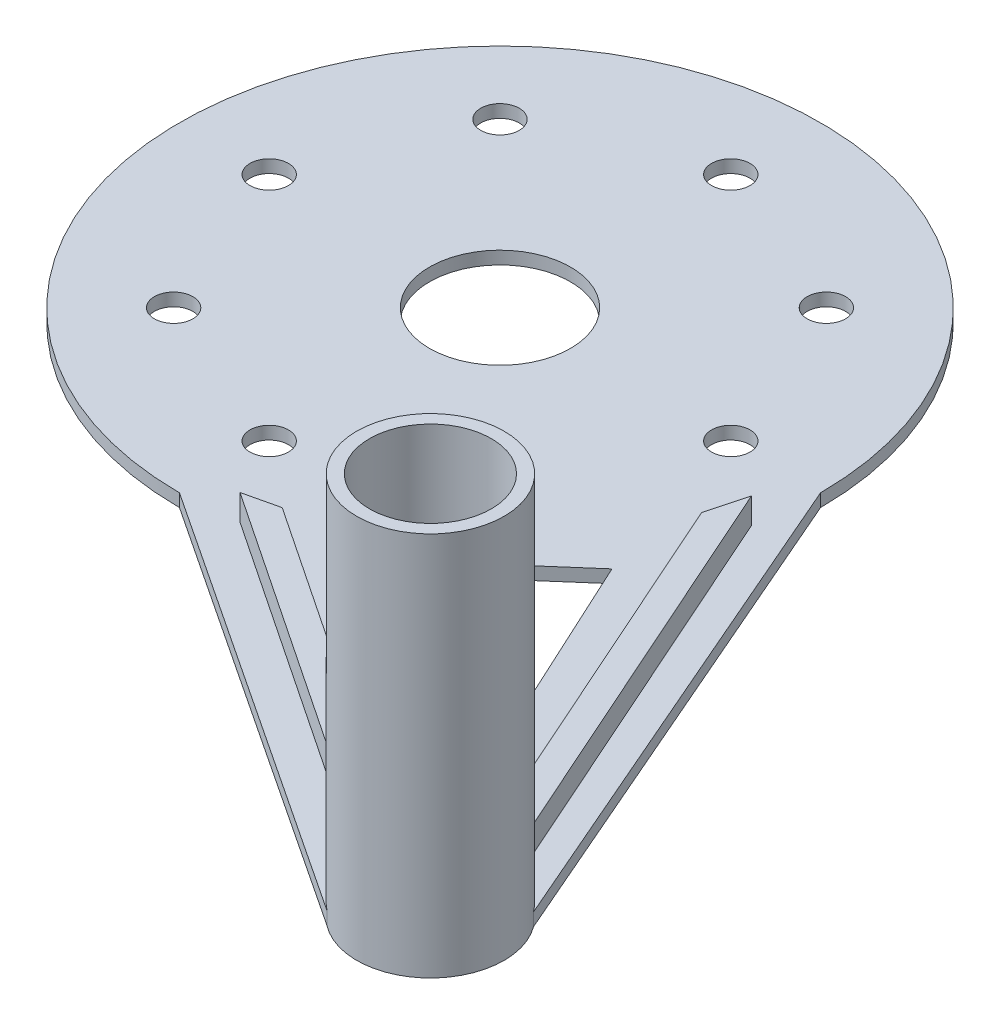
ISO-10303-21;
HEADER;
FILE_DESCRIPTION(('STEP AP214'),'2;1');
FILE_NAME('part.step','',(''),(''),'','','');
FILE_SCHEMA(('AUTOMOTIVE_DESIGN { 1 0 10303 214 1 1 1 1 }'));
ENDSEC;
DATA;
#1=APPLICATION_CONTEXT('core data for automotive mechanical design processes');
#2=APPLICATION_PROTOCOL_DEFINITION('international standard','automotive_design',2000,#1);
#3=PRODUCT_CONTEXT('',#1,'mechanical');
#4=PRODUCT('Part','Part','',(#3));
#5=PRODUCT_RELATED_PRODUCT_CATEGORY('part','',(#4));
#6=PRODUCT_DEFINITION_FORMATION('','',#4);
#7=PRODUCT_DEFINITION_CONTEXT('part definition',#1,'design');
#8=PRODUCT_DEFINITION('design','',#6,#7);
#9=PRODUCT_DEFINITION_SHAPE('','',#8);
#10=(LENGTH_UNIT() NAMED_UNIT(*) SI_UNIT(.MILLI.,.METRE.));
#11=(NAMED_UNIT(*) PLANE_ANGLE_UNIT() SI_UNIT($,.RADIAN.));
#12=(NAMED_UNIT(*) SI_UNIT($,.STERADIAN.) SOLID_ANGLE_UNIT());
#13=UNCERTAINTY_MEASURE_WITH_UNIT(LENGTH_MEASURE(1.E-05),#10,'distance_accuracy_value','');
#14=(GEOMETRIC_REPRESENTATION_CONTEXT(3) GLOBAL_UNCERTAINTY_ASSIGNED_CONTEXT((#13)) GLOBAL_UNIT_ASSIGNED_CONTEXT((#10,
#11,#12)) REPRESENTATION_CONTEXT('',''));
#15=CARTESIAN_POINT('',(0.,0.,0.));
#16=DIRECTION('',(0.,0.,1.));
#17=DIRECTION('',(1.,0.,0.));
#18=AXIS2_PLACEMENT_3D('',#15,#16,#17);
#19=CARTESIAN_POINT('',(37.5,1.,42.9272640637625));
#20=DIRECTION('',(0.,1.,0.));
#21=DIRECTION('',(0.,0.,1.));
#22=AXIS2_PLACEMENT_3D('',#19,#20,#21);
#23=PLANE('',#22);
#24=CARTESIAN_POINT('',(18.,1.,1.89805075011018E-13));
#25=DIRECTION('',(0.,1.,0.));
#26=DIRECTION('',(0.,0.,1.));
#27=AXIS2_PLACEMENT_3D('',#24,#25,#26);
#28=CIRCLE('',#27,1.5);
#29=CARTESIAN_POINT('',(18.,1.,1.50000000000019));
#30=VERTEX_POINT('',#29);
#31=EDGE_CURVE('E236',#30,#30,#28,.T.);
#32=ORIENTED_EDGE('',*,*,#31,.F.);
#33=EDGE_LOOP('',(#32));
#34=FACE_BOUND('',#33,.T.);
#35=CARTESIAN_POINT('',(1.23488963959888E-13,1.,-18.));
#36=DIRECTION('',(0.,1.,0.));
#37=DIRECTION('',(0.,0.,1.));
#38=AXIS2_PLACEMENT_3D('',#35,#36,#37);
#39=CIRCLE('',#38,1.5);
#40=CARTESIAN_POINT('',(1.23488963959888E-13,1.,-16.5));
#41=VERTEX_POINT('',#40);
#42=EDGE_CURVE('E248',#41,#41,#39,.T.);
#43=ORIENTED_EDGE('',*,*,#42,.F.);
#44=EDGE_LOOP('',(#43));
#45=FACE_BOUND('',#44,.T.);
#46=CARTESIAN_POINT('',(-18.,1.,0.));
#47=DIRECTION('',(0.,1.,0.));
#48=DIRECTION('',(0.,0.,1.));
#49=AXIS2_PLACEMENT_3D('',#46,#47,#48);
#50=CIRCLE('',#49,1.5);
#51=CARTESIAN_POINT('',(-18.,1.,1.49999999999994));
#52=VERTEX_POINT('',#51);
#53=EDGE_CURVE('E260',#52,#52,#50,.T.);
#54=ORIENTED_EDGE('',*,*,#53,.F.);
#55=EDGE_LOOP('',(#54));
#56=FACE_BOUND('',#55,.T.);
#57=CARTESIAN_POINT('',(0.,1.,18.));
#58=DIRECTION('',(0.,1.,0.));
#59=DIRECTION('',(0.,0.,1.));
#60=AXIS2_PLACEMENT_3D('',#57,#58,#59);
#61=CIRCLE('',#60,1.5);
#62=CARTESIAN_POINT('',(0.,1.,19.5));
#63=VERTEX_POINT('',#62);
#64=EDGE_CURVE('E272',#63,#63,#61,.T.);
#65=ORIENTED_EDGE('',*,*,#64,.F.);
#66=EDGE_LOOP('',(#65));
#67=FACE_BOUND('',#66,.T.);
#68=CARTESIAN_POINT('',(0.,1.,0.));
#69=DIRECTION('',(0.,1.,0.));
#70=DIRECTION('',(0.,0.,1.));
#71=AXIS2_PLACEMENT_3D('',#68,#69,#70);
#72=CIRCLE('',#71,5.5);
#73=CARTESIAN_POINT('',(0.,1.,5.5));
#74=VERTEX_POINT('',#73);
#75=EDGE_CURVE('E278',#74,#74,#72,.T.);
#76=ORIENTED_EDGE('',*,*,#75,.F.);
#77=EDGE_LOOP('',(#76));
#78=FACE_BOUND('',#77,.T.);
#79=CARTESIAN_POINT('',(-12.7279220613579,1.,12.7279220613578));
#80=DIRECTION('',(0.,1.,0.));
#81=DIRECTION('',(0.,0.,1.));
#82=AXIS2_PLACEMENT_3D('',#79,#80,#81);
#83=CIRCLE('',#82,1.5);
#84=CARTESIAN_POINT('',(-12.7279220613579,1.,14.2279220613578));
#85=VERTEX_POINT('',#84);
#86=EDGE_CURVE('E266',#85,#85,#83,.T.);
#87=ORIENTED_EDGE('',*,*,#86,.F.);
#88=EDGE_LOOP('',(#87));
#89=FACE_BOUND('',#88,.T.);
#90=CARTESIAN_POINT('',(-12.7279220613578,1.,-12.7279220613579));
#91=DIRECTION('',(0.,1.,0.));
#92=DIRECTION('',(0.,0.,1.));
#93=AXIS2_PLACEMENT_3D('',#90,#91,#92);
#94=CIRCLE('',#93,1.5);
#95=CARTESIAN_POINT('',(-12.7279220613578,1.,-11.2279220613579));
#96=VERTEX_POINT('',#95);
#97=EDGE_CURVE('E254',#96,#96,#94,.T.);
#98=ORIENTED_EDGE('',*,*,#97,.F.);
#99=EDGE_LOOP('',(#98));
#100=FACE_BOUND('',#99,.T.);
#101=CARTESIAN_POINT('',(12.727922061358,1.,-12.7279220613577));
#102=DIRECTION('',(0.,1.,0.));
#103=DIRECTION('',(0.,0.,1.));
#104=AXIS2_PLACEMENT_3D('',#101,#102,#103);
#105=CIRCLE('',#104,1.5);
#106=CARTESIAN_POINT('',(12.727922061358,1.,-11.2279220613577));
#107=VERTEX_POINT('',#106);
#108=EDGE_CURVE('E242',#107,#107,#105,.T.);
#109=ORIENTED_EDGE('',*,*,#108,.F.);
#110=EDGE_LOOP('',(#109));
#111=FACE_BOUND('',#110,.T.);
#112=CARTESIAN_POINT('',(12.7279220613577,1.,12.727922061358));
#113=DIRECTION('',(0.,1.,0.));
#114=DIRECTION('',(0.,0.,1.));
#115=AXIS2_PLACEMENT_3D('',#112,#113,#114);
#116=CIRCLE('',#115,1.5);
#117=CARTESIAN_POINT('',(12.7279220613577,1.,14.227922061358));
#118=VERTEX_POINT('',#117);
#119=EDGE_CURVE('E230',#118,#118,#116,.T.);
#120=ORIENTED_EDGE('',*,*,#119,.F.);
#121=EDGE_LOOP('',(#120));
#122=FACE_BOUND('',#121,.T.);
#123=DIRECTION('',(-0.257967944638198,0.,0.966153476182301));
#124=VECTOR('',#123,1.);
#125=CARTESIAN_POINT('',(24.5152514726974,1.,4.89922904449338));
#126=LINE('',#125,#124);
#127=CARTESIAN_POINT('',(24.5152514726974,1.,4.89922904449338));
#128=VERTEX_POINT('',#127);
#129=CARTESIAN_POINT('',(23.6945306551304,1.,7.97303060530217));
#130=VERTEX_POINT('',#129);
#131=EDGE_CURVE('E50',#128,#130,#126,.T.);
#132=ORIENTED_EDGE('',*,*,#131,.F.);
#133=DIRECTION('',(-0.406739041840406,0.,-0.913544389640015));
#134=VECTOR('',#133,1.);
#135=CARTESIAN_POINT('',(38.971739634211,1.,37.3688036250176));
#136=LINE('',#135,#134);
#137=CARTESIAN_POINT('',(38.971739634211,1.,37.3688036250176));
#138=VERTEX_POINT('',#137);
#139=EDGE_CURVE('E170',#138,#128,#136,.T.);
#140=ORIENTED_EDGE('',*,*,#139,.F.);
#141=CARTESIAN_POINT('',(37.5,1.,42.9272640637625));
#142=DIRECTION('',(0.,1.,0.));
#143=DIRECTION('',(0.,0.,1.));
#144=AXIS2_PLACEMENT_3D('',#141,#142,#143);
#145=CIRCLE('',#144,5.75);
#146=CARTESIAN_POINT('',(42.1161587762646,0.999999999999997,39.4989148761337));
#147=VERTEX_POINT('',#146);
#148=EDGE_CURVE('E144',#138,#147,#145,.F.);
#149=ORIENTED_EDGE('',*,*,#148,.T.);
#150=DIRECTION('',(-0.397606700903918,0.,-0.917555944559405));
#151=VECTOR('',#150,1.);
#152=CARTESIAN_POINT('',(25.,1.,0.));
#153=LINE('',#152,#151);
#154=CARTESIAN_POINT('',(25.,1.,0.));
#155=VERTEX_POINT('',#154);
#156=EDGE_CURVE('E292',#147,#155,#153,.T.);
#157=ORIENTED_EDGE('',*,*,#156,.T.);
#158=CARTESIAN_POINT('',(0.,1.,0.));
#159=DIRECTION('',(0.,1.,0.));
#160=DIRECTION('',(0.,0.,1.));
#161=AXIS2_PLACEMENT_3D('',#158,#159,#160);
#162=CIRCLE('',#161,25.);
#163=CARTESIAN_POINT('',(0.,1.,25.));
#164=VERTEX_POINT('',#163);
#165=EDGE_CURVE('E284',#155,#164,#162,.T.);
#166=ORIENTED_EDGE('',*,*,#165,.T.);
#167=DIRECTION('',(0.834082354115995,0.,0.551639942854322));
#168=VECTOR('',#167,1.);
#169=CARTESIAN_POINT('',(0.,1.,25.));
#170=LINE('',#169,#168);
#171=CARTESIAN_POINT('',(33.9760220531749,1.,47.4708396854828));
#172=VERTEX_POINT('',#171);
#173=EDGE_CURVE('E290',#164,#172,#170,.T.);
#174=ORIENTED_EDGE('',*,*,#173,.T.);
#175=CARTESIAN_POINT('',(31.75,1.,42.9272640637625));
#176=VERTEX_POINT('',#175);
#177=EDGE_CURVE('E224',#172,#176,#145,.F.);
#178=ORIENTED_EDGE('',*,*,#177,.T.);
#179=DIRECTION('',(0.831556901500634,0.,0.555439573281077));
#180=VECTOR('',#179,1.);
#181=CARTESIAN_POINT('',(31.75,1.,42.9272640637625));
#182=LINE('',#181,#180);
#183=CARTESIAN_POINT('',(4.34200079896958,1.,24.6200533927477));
#184=VERTEX_POINT('',#183);
#185=EDGE_CURVE('E182',#184,#176,#182,.T.);
#186=ORIENTED_EDGE('',*,*,#185,.F.);
#187=DIRECTION('',(-0.973805425643835,0.,0.227382921492862));
#188=VECTOR('',#187,1.);
#189=CARTESIAN_POINT('',(4.34200079896958,1.,24.6200533927477));
#190=LINE('',#189,#188);
#191=CARTESIAN_POINT('',(7.0100635431187,1.,23.9970625102623));
#192=VERTEX_POINT('',#191);
#193=EDGE_CURVE('E190',#192,#184,#190,.T.);
#194=ORIENTED_EDGE('',*,*,#193,.F.);
#195=DIRECTION('',(-0.831556901500634,0.,-0.555439573281077));
#196=VECTOR('',#195,1.);
#197=CARTESIAN_POINT('',(7.0100635431187,1.,23.9970625102623));
#198=LINE('',#197,#196);
#199=CARTESIAN_POINT('',(32.1596598808811,1.,40.7957698901535));
#200=VERTEX_POINT('',#199);
#201=EDGE_CURVE('E147',#200,#192,#198,.T.);
#202=ORIENTED_EDGE('',*,*,#201,.F.);
#203=CARTESIAN_POINT('',(33.7171052631579,1.,38.5968821625935));
#204=VERTEX_POINT('',#203);
#205=EDGE_CURVE('E228',#200,#204,#145,.F.);
#206=ORIENTED_EDGE('',*,*,#205,.T.);
#207=DIRECTION('',(0.844276420330165,0.,0.535907945522813));
#208=VECTOR('',#207,1.);
#209=CARTESIAN_POINT('',(10.1451785504698,1.,23.6345043057407));
#210=LINE('',#209,#208);
#211=CARTESIAN_POINT('',(10.1451785504698,1.,23.6345043057407));
#212=VERTEX_POINT('',#211);
#213=EDGE_CURVE('E205',#212,#204,#210,.T.);
#214=ORIENTED_EDGE('',*,*,#213,.F.);
#215=DIRECTION('',(-0.753109895855483,0.,0.657894736842105));
#216=VECTOR('',#215,1.);
#217=CARTESIAN_POINT('',(16.1012096374802,1.,18.4314900761096));
#218=LINE('',#217,#216);
#219=CARTESIAN_POINT('',(22.0068158234685,1.,13.272525562424));
#220=VERTEX_POINT('',#219);
#221=EDGE_CURVE('E211',#220,#212,#218,.T.);
#222=ORIENTED_EDGE('',*,*,#221,.F.);
#223=DIRECTION('',(-0.419711796445546,0.,-0.90765742872763));
#224=VECTOR('',#223,1.);
#225=CARTESIAN_POINT('',(22.0068158234685,1.,13.272525562424));
#226=LINE('',#225,#224);
#227=EDGE_CURVE('E208',#204,#220,#226,.T.);
#228=ORIENTED_EDGE('',*,*,#227,.F.);
#229=CARTESIAN_POINT('',(36.7208003150846,1.,37.2303045368721));
#230=VERTEX_POINT('',#229);
#231=EDGE_CURVE('E229',#204,#230,#145,.F.);
#232=ORIENTED_EDGE('',*,*,#231,.T.);
#233=DIRECTION('',(0.406739041840406,0.,0.913544389640015));
#234=VECTOR('',#233,1.);
#235=CARTESIAN_POINT('',(23.6945306551304,1.,7.97303060530216));
#236=LINE('',#235,#234);
#237=EDGE_CURVE('E55',#130,#230,#236,.T.);
#238=ORIENTED_EDGE('',*,*,#237,.F.);
#239=EDGE_LOOP('',(#132,#140,#149,#157,#166,#174,#178,#186,#194,#202,#206,#214,#222,#228,#232,#238));
#240=FACE_BOUND('',#239,.T.);
#241=ADVANCED_FACE('F35',(#34,#45,#56,#67,#78,#89,#100,#111,#122,#240),#23,.T.);
#242=CARTESIAN_POINT('',(37.5,1.,42.9272640637625));
#243=DIRECTION('',(0.,-1.,0.));
#244=DIRECTION('',(0.,0.,-1.));
#245=AXIS2_PLACEMENT_3D('',#242,#243,#244);
#246=CYLINDRICAL_SURFACE('',#245,5.74999999999999);
#247=CARTESIAN_POINT('',(37.5,30.,42.9272640637625));
#248=DIRECTION('',(0.,1.,0.));
#249=DIRECTION('',(0.,0.,1.));
#250=AXIS2_PLACEMENT_3D('',#247,#248,#249);
#251=CIRCLE('',#250,5.75);
#252=CARTESIAN_POINT('',(37.5,30.,48.6772640637625));
#253=VERTEX_POINT('',#252);
#254=EDGE_CURVE('E216',#253,#253,#251,.T.);
#255=ORIENTED_EDGE('',*,*,#254,.F.);
#256=EDGE_LOOP('',(#255));
#257=FACE_BOUND('',#256,.T.);
#258=DIRECTION('',(0.,-1.,0.));
#259=VECTOR('',#258,1.);
#260=CARTESIAN_POINT('',(38.971739634211,3.,37.3688036250176));
#261=LINE('',#260,#259);
#262=CARTESIAN_POINT('',(38.971739634211,3.,37.3688036250176));
#263=VERTEX_POINT('',#262);
#264=EDGE_CURVE('E141',#263,#138,#261,.T.);
#265=ORIENTED_EDGE('',*,*,#264,.F.);
#266=CARTESIAN_POINT('',(37.5,3.,42.9272640637625));
#267=DIRECTION('',(0.,-1.,0.));
#268=DIRECTION('',(0.,0.,-1.));
#269=AXIS2_PLACEMENT_3D('',#266,#267,#268);
#270=CIRCLE('',#269,5.74999999999999);
#271=CARTESIAN_POINT('',(36.7208003150846,3.,37.2303045368721));
#272=VERTEX_POINT('',#271);
#273=EDGE_CURVE('E11',#272,#263,#270,.T.);
#274=ORIENTED_EDGE('',*,*,#273,.F.);
#275=DIRECTION('',(0.,-1.,0.));
#276=VECTOR('',#275,1.);
#277=CARTESIAN_POINT('',(36.7208003150846,3.,37.2303045368721));
#278=LINE('',#277,#276);
#279=EDGE_CURVE('E169',#272,#230,#278,.T.);
#280=ORIENTED_EDGE('',*,*,#279,.T.);
#281=ORIENTED_EDGE('',*,*,#231,.F.);
#282=ORIENTED_EDGE('',*,*,#205,.F.);
#283=DIRECTION('',(0.,-1.,0.));
#284=VECTOR('',#283,1.);
#285=CARTESIAN_POINT('',(32.1596598808811,3.,40.7957698901535));
#286=LINE('',#285,#284);
#287=CARTESIAN_POINT('',(32.1596598808811,3.,40.7957698901535));
#288=VERTEX_POINT('',#287);
#289=EDGE_CURVE('E202',#288,#200,#286,.T.);
#290=ORIENTED_EDGE('',*,*,#289,.F.);
#291=CARTESIAN_POINT('',(37.5,3.,42.9272640637625));
#292=DIRECTION('',(0.,-1.,0.));
#293=DIRECTION('',(0.,0.,-1.));
#294=AXIS2_PLACEMENT_3D('',#291,#292,#293);
#295=CIRCLE('',#294,5.74999999999999);
#296=CARTESIAN_POINT('',(31.75,3.,42.9272640637625));
#297=VERTEX_POINT('',#296);
#298=EDGE_CURVE('E43',#297,#288,#295,.T.);
#299=ORIENTED_EDGE('',*,*,#298,.F.);
#300=DIRECTION('',(0.,-1.,0.));
#301=VECTOR('',#300,1.);
#302=CARTESIAN_POINT('',(31.75,3.,42.9272640637625));
#303=LINE('',#302,#301);
#304=EDGE_CURVE('E187',#297,#176,#303,.T.);
#305=ORIENTED_EDGE('',*,*,#304,.T.);
#306=ORIENTED_EDGE('',*,*,#177,.F.);
#307=DIRECTION('',(0.,-1.,0.));
#308=VECTOR('',#307,1.);
#309=CARTESIAN_POINT('',(33.9760220531749,1.,47.4708396854828));
#310=LINE('',#309,#308);
#311=CARTESIAN_POINT('',(33.9760220531749,0.,47.4708396854828));
#312=VERTEX_POINT('',#311);
#313=EDGE_CURVE('E304',#172,#312,#310,.T.);
#314=ORIENTED_EDGE('',*,*,#313,.T.);
#315=CARTESIAN_POINT('',(37.5,0.,42.9272640637625));
#316=DIRECTION('',(0.,1.,0.));
#317=DIRECTION('',(0.,0.,1.));
#318=AXIS2_PLACEMENT_3D('',#315,#316,#317);
#319=CIRCLE('',#318,5.74999999999999);
#320=CARTESIAN_POINT('',(42.1161587762646,0.,39.4989148761337));
#321=VERTEX_POINT('',#320);
#322=EDGE_CURVE('E310',#312,#321,#319,.T.);
#323=ORIENTED_EDGE('',*,*,#322,.T.);
#324=DIRECTION('',(0.,-1.,0.));
#325=VECTOR('',#324,1.);
#326=CARTESIAN_POINT('',(42.1161587762646,1.,39.4989148761337));
#327=LINE('',#326,#325);
#328=EDGE_CURVE('E301',#147,#321,#327,.T.);
#329=ORIENTED_EDGE('',*,*,#328,.F.);
#330=ORIENTED_EDGE('',*,*,#148,.F.);
#331=EDGE_LOOP('',(#265,#274,#280,#281,#282,#290,#299,#305,#306,#314,#323,#329,#330));
#332=FACE_BOUND('',#331,.T.);
#333=ADVANCED_FACE('F37',(#257,#332),#246,.T.);
#334=CARTESIAN_POINT('',(37.5,0.,42.9272640637625));
#335=DIRECTION('',(0.,1.,0.));
#336=DIRECTION('',(0.,0.,1.));
#337=AXIS2_PLACEMENT_3D('',#334,#335,#336);
#338=PLANE('',#337);
#339=CARTESIAN_POINT('',(37.5,0.,42.9272640637625));
#340=DIRECTION('',(0.,1.,0.));
#341=DIRECTION('',(0.,0.,1.));
#342=AXIS2_PLACEMENT_3D('',#339,#340,#341);
#343=CIRCLE('',#342,4.75);
#344=CARTESIAN_POINT('',(37.5,0.,47.6772640637625));
#345=VERTEX_POINT('',#344);
#346=EDGE_CURVE('E172',#345,#345,#343,.T.);
#347=ORIENTED_EDGE('',*,*,#346,.T.);
#348=EDGE_LOOP('',(#347));
#349=FACE_BOUND('',#348,.T.);
#350=DIRECTION('',(-0.419711796445546,0.,-0.90765742872763));
#351=VECTOR('',#350,1.);
#352=CARTESIAN_POINT('',(36.0331710059768,0.,43.605543569526));
#353=LINE('',#352,#351);
#354=CARTESIAN_POINT('',(33.7171052631579,0.,38.5968821625935));
#355=VERTEX_POINT('',#354);
#356=CARTESIAN_POINT('',(22.0068158234685,0.,13.272525562424));
#357=VERTEX_POINT('',#356);
#358=EDGE_CURVE('E315',#355,#357,#353,.T.);
#359=ORIENTED_EDGE('',*,*,#358,.T.);
#360=DIRECTION('',(-0.753109895855483,0.,0.657894736842105));
#361=VECTOR('',#360,1.);
#362=CARTESIAN_POINT('',(16.1012096374802,0.,18.4314900761096));
#363=LINE('',#362,#361);
#364=CARTESIAN_POINT('',(10.1451785504698,0.,23.6345043057407));
#365=VERTEX_POINT('',#364);
#366=EDGE_CURVE('E318',#357,#365,#363,.T.);
#367=ORIENTED_EDGE('',*,*,#366,.T.);
#368=DIRECTION('',(0.844276420330165,0.,0.535907945522813));
#369=VECTOR('',#368,1.);
#370=CARTESIAN_POINT('',(38.3728632729459,0.,41.5521437923109));
#371=LINE('',#370,#369);
#372=EDGE_CURVE('E312',#365,#355,#371,.T.);
#373=ORIENTED_EDGE('',*,*,#372,.T.);
#374=EDGE_LOOP('',(#359,#367,#373));
#375=FACE_BOUND('',#374,.T.);
#376=ORIENTED_EDGE('',*,*,#322,.F.);
#377=DIRECTION('',(0.834082354115995,0.,0.551639942854322));
#378=VECTOR('',#377,1.);
#379=CARTESIAN_POINT('',(0.,0.,25.));
#380=LINE('',#379,#378);
#381=CARTESIAN_POINT('',(0.,0.,25.));
#382=VERTEX_POINT('',#381);
#383=EDGE_CURVE('E287',#382,#312,#380,.T.);
#384=ORIENTED_EDGE('',*,*,#383,.F.);
#385=CARTESIAN_POINT('',(0.,0.,0.));
#386=DIRECTION('',(0.,1.,0.));
#387=DIRECTION('',(0.,0.,1.));
#388=AXIS2_PLACEMENT_3D('',#385,#386,#387);
#389=CIRCLE('',#388,25.);
#390=CARTESIAN_POINT('',(25.,0.,0.));
#391=VERTEX_POINT('',#390);
#392=EDGE_CURVE('E281',#391,#382,#389,.T.);
#393=ORIENTED_EDGE('',*,*,#392,.F.);
#394=DIRECTION('',(-0.397606700903918,0.,-0.917555944559405));
#395=VECTOR('',#394,1.);
#396=CARTESIAN_POINT('',(25.,0.,0.));
#397=LINE('',#396,#395);
#398=EDGE_CURVE('E293',#321,#391,#397,.T.);
#399=ORIENTED_EDGE('',*,*,#398,.F.);
#400=EDGE_LOOP('',(#376,#384,#393,#399));
#401=FACE_BOUND('',#400,.T.);
#402=CARTESIAN_POINT('',(18.,0.,1.89805075011018E-13));
#403=DIRECTION('',(0.,1.,0.));
#404=DIRECTION('',(0.,0.,1.));
#405=AXIS2_PLACEMENT_3D('',#402,#403,#404);
#406=CIRCLE('',#405,1.5);
#407=CARTESIAN_POINT('',(18.,0.,1.50000000000019));
#408=VERTEX_POINT('',#407);
#409=EDGE_CURVE('E233',#408,#408,#406,.T.);
#410=ORIENTED_EDGE('',*,*,#409,.T.);
#411=EDGE_LOOP('',(#410));
#412=FACE_BOUND('',#411,.T.);
#413=CARTESIAN_POINT('',(1.23488963959888E-13,0.,-18.));
#414=DIRECTION('',(0.,1.,0.));
#415=DIRECTION('',(0.,0.,1.));
#416=AXIS2_PLACEMENT_3D('',#413,#414,#415);
#417=CIRCLE('',#416,1.5);
#418=CARTESIAN_POINT('',(1.23488963959888E-13,0.,-16.5));
#419=VERTEX_POINT('',#418);
#420=EDGE_CURVE('E245',#419,#419,#417,.T.);
#421=ORIENTED_EDGE('',*,*,#420,.T.);
#422=EDGE_LOOP('',(#421));
#423=FACE_BOUND('',#422,.T.);
#424=CARTESIAN_POINT('',(-18.,0.,0.));
#425=DIRECTION('',(0.,1.,0.));
#426=DIRECTION('',(0.,0.,1.));
#427=AXIS2_PLACEMENT_3D('',#424,#425,#426);
#428=CIRCLE('',#427,1.5);
#429=CARTESIAN_POINT('',(-18.,0.,1.49999999999994));
#430=VERTEX_POINT('',#429);
#431=EDGE_CURVE('E257',#430,#430,#428,.T.);
#432=ORIENTED_EDGE('',*,*,#431,.T.);
#433=EDGE_LOOP('',(#432));
#434=FACE_BOUND('',#433,.T.);
#435=CARTESIAN_POINT('',(0.,0.,18.));
#436=DIRECTION('',(0.,1.,0.));
#437=DIRECTION('',(0.,0.,1.));
#438=AXIS2_PLACEMENT_3D('',#435,#436,#437);
#439=CIRCLE('',#438,1.5);
#440=CARTESIAN_POINT('',(0.,0.,19.5));
#441=VERTEX_POINT('',#440);
#442=EDGE_CURVE('E269',#441,#441,#439,.T.);
#443=ORIENTED_EDGE('',*,*,#442,.T.);
#444=EDGE_LOOP('',(#443));
#445=FACE_BOUND('',#444,.T.);
#446=CARTESIAN_POINT('',(0.,0.,0.));
#447=DIRECTION('',(0.,1.,0.));
#448=DIRECTION('',(0.,0.,1.));
#449=AXIS2_PLACEMENT_3D('',#446,#447,#448);
#450=CIRCLE('',#449,5.5);
#451=CARTESIAN_POINT('',(0.,0.,5.5));
#452=VERTEX_POINT('',#451);
#453=EDGE_CURVE('E275',#452,#452,#450,.T.);
#454=ORIENTED_EDGE('',*,*,#453,.T.);
#455=EDGE_LOOP('',(#454));
#456=FACE_BOUND('',#455,.T.);
#457=CARTESIAN_POINT('',(-12.7279220613579,0.,12.7279220613578));
#458=DIRECTION('',(0.,1.,0.));
#459=DIRECTION('',(0.,0.,1.));
#460=AXIS2_PLACEMENT_3D('',#457,#458,#459);
#461=CIRCLE('',#460,1.5);
#462=CARTESIAN_POINT('',(-12.7279220613579,0.,14.2279220613578));
#463=VERTEX_POINT('',#462);
#464=EDGE_CURVE('E263',#463,#463,#461,.T.);
#465=ORIENTED_EDGE('',*,*,#464,.T.);
#466=EDGE_LOOP('',(#465));
#467=FACE_BOUND('',#466,.T.);
#468=CARTESIAN_POINT('',(-12.7279220613578,0.,-12.7279220613579));
#469=DIRECTION('',(0.,1.,0.));
#470=DIRECTION('',(0.,0.,1.));
#471=AXIS2_PLACEMENT_3D('',#468,#469,#470);
#472=CIRCLE('',#471,1.5);
#473=CARTESIAN_POINT('',(-12.7279220613578,0.,-11.2279220613579));
#474=VERTEX_POINT('',#473);
#475=EDGE_CURVE('E251',#474,#474,#472,.T.);
#476=ORIENTED_EDGE('',*,*,#475,.T.);
#477=EDGE_LOOP('',(#476));
#478=FACE_BOUND('',#477,.T.);
#479=CARTESIAN_POINT('',(12.727922061358,0.,-12.7279220613577));
#480=DIRECTION('',(0.,1.,0.));
#481=DIRECTION('',(0.,0.,1.));
#482=AXIS2_PLACEMENT_3D('',#479,#480,#481);
#483=CIRCLE('',#482,1.5);
#484=CARTESIAN_POINT('',(12.727922061358,0.,-11.2279220613577));
#485=VERTEX_POINT('',#484);
#486=EDGE_CURVE('E239',#485,#485,#483,.T.);
#487=ORIENTED_EDGE('',*,*,#486,.T.);
#488=EDGE_LOOP('',(#487));
#489=FACE_BOUND('',#488,.T.);
#490=CARTESIAN_POINT('',(12.7279220613577,0.,12.727922061358));
#491=DIRECTION('',(0.,1.,0.));
#492=DIRECTION('',(0.,0.,1.));
#493=AXIS2_PLACEMENT_3D('',#490,#491,#492);
#494=CIRCLE('',#493,1.5);
#495=CARTESIAN_POINT('',(12.7279220613577,0.,14.227922061358));
#496=VERTEX_POINT('',#495);
#497=EDGE_CURVE('E227',#496,#496,#494,.T.);
#498=ORIENTED_EDGE('',*,*,#497,.T.);
#499=EDGE_LOOP('',(#498));
#500=FACE_BOUND('',#499,.T.);
#501=ADVANCED_FACE('F348',(#349,#375,#401,#412,#423,#434,#445,#456,#467,#478,#489,#500),#338,.F.);
#502=CARTESIAN_POINT('',(0.,1.,25.));
#503=DIRECTION('',(0.551639942854322,0.,-0.834082354115995));
#504=DIRECTION('',(-0.834082354115995,0.,-0.551639942854322));
#505=AXIS2_PLACEMENT_3D('',#502,#503,#504);
#506=PLANE('',#505);
#507=ORIENTED_EDGE('',*,*,#383,.T.);
#508=ORIENTED_EDGE('',*,*,#313,.F.);
#509=ORIENTED_EDGE('',*,*,#173,.F.);
#510=DIRECTION('',(0.,-1.,0.));
#511=VECTOR('',#510,1.);
#512=CARTESIAN_POINT('',(0.,1.,25.));
#513=LINE('',#512,#511);
#514=EDGE_CURVE('E307',#164,#382,#513,.T.);
#515=ORIENTED_EDGE('',*,*,#514,.T.);
#516=EDGE_LOOP('',(#507,#508,#509,#515));
#517=FACE_BOUND('',#516,.T.);
#518=ADVANCED_FACE('F340',(#517),#506,.F.);
#519=CARTESIAN_POINT('',(25.,1.,0.));
#520=DIRECTION('',(-0.917555944559405,0.,0.397606700903918));
#521=DIRECTION('',(0.397606700903918,0.,0.917555944559405));
#522=AXIS2_PLACEMENT_3D('',#519,#520,#521);
#523=PLANE('',#522);
#524=ORIENTED_EDGE('',*,*,#398,.T.);
#525=DIRECTION('',(0.,-1.,0.));
#526=VECTOR('',#525,1.);
#527=CARTESIAN_POINT('',(25.,1.,0.));
#528=LINE('',#527,#526);
#529=EDGE_CURVE('E295',#155,#391,#528,.T.);
#530=ORIENTED_EDGE('',*,*,#529,.F.);
#531=ORIENTED_EDGE('',*,*,#156,.F.);
#532=ORIENTED_EDGE('',*,*,#328,.T.);
#533=EDGE_LOOP('',(#524,#530,#531,#532));
#534=FACE_BOUND('',#533,.T.);
#535=ADVANCED_FACE('F345',(#534),#523,.F.);
#536=CARTESIAN_POINT('',(0.,1.,0.));
#537=DIRECTION('',(0.,-1.,0.));
#538=DIRECTION('',(0.,0.,-1.));
#539=AXIS2_PLACEMENT_3D('',#536,#537,#538);
#540=CYLINDRICAL_SURFACE('',#539,25.);
#541=ORIENTED_EDGE('',*,*,#392,.T.);
#542=ORIENTED_EDGE('',*,*,#514,.F.);
#543=ORIENTED_EDGE('',*,*,#165,.F.);
#544=ORIENTED_EDGE('',*,*,#529,.T.);
#545=EDGE_LOOP('',(#541,#542,#543,#544));
#546=FACE_BOUND('',#545,.T.);
#547=ADVANCED_FACE('F351',(#546),#540,.T.);
#548=CARTESIAN_POINT('',(0.,1.,0.));
#549=DIRECTION('',(0.,-1.,0.));
#550=DIRECTION('',(0.,0.,-1.));
#551=AXIS2_PLACEMENT_3D('',#548,#549,#550);
#552=CYLINDRICAL_SURFACE('',#551,5.5);
#553=ORIENTED_EDGE('',*,*,#75,.T.);
#554=EDGE_LOOP('',(#553));
#555=FACE_BOUND('',#554,.T.);
#556=ORIENTED_EDGE('',*,*,#453,.F.);
#557=EDGE_LOOP('',(#556));
#558=FACE_BOUND('',#557,.T.);
#559=ADVANCED_FACE('F353',(#555,#558),#552,.F.);
#560=CARTESIAN_POINT('',(0.,1.,18.));
#561=DIRECTION('',(0.,-1.,0.));
#562=DIRECTION('',(0.,0.,-1.));
#563=AXIS2_PLACEMENT_3D('',#560,#561,#562);
#564=CYLINDRICAL_SURFACE('',#563,1.5);
#565=ORIENTED_EDGE('',*,*,#64,.T.);
#566=EDGE_LOOP('',(#565));
#567=FACE_BOUND('',#566,.T.);
#568=ORIENTED_EDGE('',*,*,#442,.F.);
#569=EDGE_LOOP('',(#568));
#570=FACE_BOUND('',#569,.T.);
#571=ADVANCED_FACE('F359',(#567,#570),#564,.F.);
#572=CARTESIAN_POINT('',(-12.7279220613579,1.,12.7279220613578));
#573=DIRECTION('',(0.,-1.,0.));
#574=DIRECTION('',(0.,0.,-1.));
#575=AXIS2_PLACEMENT_3D('',#572,#573,#574);
#576=CYLINDRICAL_SURFACE('',#575,1.5);
#577=ORIENTED_EDGE('',*,*,#86,.T.);
#578=EDGE_LOOP('',(#577));
#579=FACE_BOUND('',#578,.T.);
#580=ORIENTED_EDGE('',*,*,#464,.F.);
#581=EDGE_LOOP('',(#580));
#582=FACE_BOUND('',#581,.T.);
#583=ADVANCED_FACE('F455',(#579,#582),#576,.F.);
#584=CARTESIAN_POINT('',(-18.,1.,0.));
#585=DIRECTION('',(0.,-1.,0.));
#586=DIRECTION('',(0.,0.,-1.));
#587=AXIS2_PLACEMENT_3D('',#584,#585,#586);
#588=CYLINDRICAL_SURFACE('',#587,1.5);
#589=ORIENTED_EDGE('',*,*,#53,.T.);
#590=EDGE_LOOP('',(#589));
#591=FACE_BOUND('',#590,.T.);
#592=ORIENTED_EDGE('',*,*,#431,.F.);
#593=EDGE_LOOP('',(#592));
#594=FACE_BOUND('',#593,.T.);
#595=ADVANCED_FACE('F451',(#591,#594),#588,.F.);
#596=CARTESIAN_POINT('',(-12.7279220613578,1.,-12.7279220613579));
#597=DIRECTION('',(0.,-1.,0.));
#598=DIRECTION('',(0.,0.,-1.));
#599=AXIS2_PLACEMENT_3D('',#596,#597,#598);
#600=CYLINDRICAL_SURFACE('',#599,1.5);
#601=ORIENTED_EDGE('',*,*,#97,.T.);
#602=EDGE_LOOP('',(#601));
#603=FACE_BOUND('',#602,.T.);
#604=ORIENTED_EDGE('',*,*,#475,.F.);
#605=EDGE_LOOP('',(#604));
#606=FACE_BOUND('',#605,.T.);
#607=ADVANCED_FACE('F447',(#603,#606),#600,.F.);
#608=CARTESIAN_POINT('',(1.23488963959888E-13,1.,-18.));
#609=DIRECTION('',(0.,-1.,0.));
#610=DIRECTION('',(0.,0.,-1.));
#611=AXIS2_PLACEMENT_3D('',#608,#609,#610);
#612=CYLINDRICAL_SURFACE('',#611,1.5);
#613=ORIENTED_EDGE('',*,*,#42,.T.);
#614=EDGE_LOOP('',(#613));
#615=FACE_BOUND('',#614,.T.);
#616=ORIENTED_EDGE('',*,*,#420,.F.);
#617=EDGE_LOOP('',(#616));
#618=FACE_BOUND('',#617,.T.);
#619=ADVANCED_FACE('F443',(#615,#618),#612,.F.);
#620=CARTESIAN_POINT('',(12.727922061358,1.,-12.7279220613577));
#621=DIRECTION('',(0.,-1.,0.));
#622=DIRECTION('',(0.,0.,-1.));
#623=AXIS2_PLACEMENT_3D('',#620,#621,#622);
#624=CYLINDRICAL_SURFACE('',#623,1.5);
#625=ORIENTED_EDGE('',*,*,#108,.T.);
#626=EDGE_LOOP('',(#625));
#627=FACE_BOUND('',#626,.T.);
#628=ORIENTED_EDGE('',*,*,#486,.F.);
#629=EDGE_LOOP('',(#628));
#630=FACE_BOUND('',#629,.T.);
#631=ADVANCED_FACE('F439',(#627,#630),#624,.F.);
#632=CARTESIAN_POINT('',(18.,1.,1.89805075011018E-13));
#633=DIRECTION('',(0.,-1.,0.));
#634=DIRECTION('',(0.,0.,-1.));
#635=AXIS2_PLACEMENT_3D('',#632,#633,#634);
#636=CYLINDRICAL_SURFACE('',#635,1.5);
#637=ORIENTED_EDGE('',*,*,#31,.T.);
#638=EDGE_LOOP('',(#637));
#639=FACE_BOUND('',#638,.T.);
#640=ORIENTED_EDGE('',*,*,#409,.F.);
#641=EDGE_LOOP('',(#640));
#642=FACE_BOUND('',#641,.T.);
#643=ADVANCED_FACE('F435',(#639,#642),#636,.F.);
#644=CARTESIAN_POINT('',(12.7279220613577,1.,12.727922061358));
#645=DIRECTION('',(0.,-1.,0.));
#646=DIRECTION('',(0.,0.,-1.));
#647=AXIS2_PLACEMENT_3D('',#644,#645,#646);
#648=CYLINDRICAL_SURFACE('',#647,1.5);
#649=ORIENTED_EDGE('',*,*,#119,.T.);
#650=EDGE_LOOP('',(#649));
#651=FACE_BOUND('',#650,.T.);
#652=ORIENTED_EDGE('',*,*,#497,.F.);
#653=EDGE_LOOP('',(#652));
#654=FACE_BOUND('',#653,.T.);
#655=ADVANCED_FACE('F431',(#651,#654),#648,.F.);
#656=CARTESIAN_POINT('',(37.5,30.,42.9272640637625));
#657=DIRECTION('',(0.,1.,0.));
#658=DIRECTION('',(0.,0.,1.));
#659=AXIS2_PLACEMENT_3D('',#656,#657,#658);
#660=PLANE('',#659);
#661=CARTESIAN_POINT('',(37.5,30.,42.9272640637625));
#662=DIRECTION('',(0.,1.,0.));
#663=DIRECTION('',(0.,0.,1.));
#664=AXIS2_PLACEMENT_3D('',#661,#662,#663);
#665=CIRCLE('',#664,4.75);
#666=CARTESIAN_POINT('',(37.5,30.,47.6772640637625));
#667=VERTEX_POINT('',#666);
#668=EDGE_CURVE('E165',#667,#667,#665,.T.);
#669=ORIENTED_EDGE('',*,*,#668,.F.);
#670=EDGE_LOOP('',(#669));
#671=FACE_BOUND('',#670,.T.);
#672=ORIENTED_EDGE('',*,*,#254,.T.);
#673=EDGE_LOOP('',(#672));
#674=FACE_BOUND('',#673,.T.);
#675=ADVANCED_FACE('F424',(#671,#674),#660,.T.);
#676=CARTESIAN_POINT('',(16.1012096374802,-29.,18.4314900761096));
#677=DIRECTION('',(-0.657894736842105,0.,-0.753109895855483));
#678=DIRECTION('',(-0.753109895855483,0.,0.657894736842105));
#679=AXIS2_PLACEMENT_3D('',#676,#677,#678);
#680=PLANE('',#679);
#681=DIRECTION('',(0.,1.,0.));
#682=VECTOR('',#681,1.);
#683=CARTESIAN_POINT('',(22.0068158234685,-29.,13.272525562424));
#684=LINE('',#683,#682);
#685=EDGE_CURVE('E214',#357,#220,#684,.T.);
#686=ORIENTED_EDGE('',*,*,#685,.T.);
#687=ORIENTED_EDGE('',*,*,#221,.T.);
#688=DIRECTION('',(0.,1.,0.));
#689=VECTOR('',#688,1.);
#690=CARTESIAN_POINT('',(10.1451785504698,-29.,23.6345043057407));
#691=LINE('',#690,#689);
#692=EDGE_CURVE('E213',#365,#212,#691,.T.);
#693=ORIENTED_EDGE('',*,*,#692,.F.);
#694=ORIENTED_EDGE('',*,*,#366,.F.);
#695=EDGE_LOOP('',(#686,#687,#693,#694));
#696=FACE_BOUND('',#695,.T.);
#697=ADVANCED_FACE('F388',(#696),#680,.F.);
#698=CARTESIAN_POINT('',(22.0068158234685,-29.,13.272525562424));
#699=DIRECTION('',(0.90765742872763,0.,-0.419711796445546));
#700=DIRECTION('',(-0.419711796445546,0.,-0.90765742872763));
#701=AXIS2_PLACEMENT_3D('',#698,#699,#700);
#702=PLANE('',#701);
#703=DIRECTION('',(0.,1.,0.));
#704=VECTOR('',#703,1.);
#705=CARTESIAN_POINT('',(33.7171052631579,-29.,38.5968821625935));
#706=LINE('',#705,#704);
#707=EDGE_CURVE('E217',#355,#204,#706,.T.);
#708=ORIENTED_EDGE('',*,*,#707,.T.);
#709=ORIENTED_EDGE('',*,*,#227,.T.);
#710=ORIENTED_EDGE('',*,*,#685,.F.);
#711=ORIENTED_EDGE('',*,*,#358,.F.);
#712=EDGE_LOOP('',(#708,#709,#710,#711));
#713=FACE_BOUND('',#712,.T.);
#714=ADVANCED_FACE('F384',(#713),#702,.F.);
#715=CARTESIAN_POINT('',(10.1451785504698,-29.,23.6345043057407));
#716=DIRECTION('',(-0.535907945522813,0.,0.844276420330165));
#717=DIRECTION('',(0.844276420330165,0.,0.535907945522813));
#718=AXIS2_PLACEMENT_3D('',#715,#716,#717);
#719=PLANE('',#718);
#720=ORIENTED_EDGE('',*,*,#692,.T.);
#721=ORIENTED_EDGE('',*,*,#213,.T.);
#722=ORIENTED_EDGE('',*,*,#707,.F.);
#723=ORIENTED_EDGE('',*,*,#372,.F.);
#724=EDGE_LOOP('',(#720,#721,#722,#723));
#725=FACE_BOUND('',#724,.T.);
#726=ADVANCED_FACE('F392',(#725),#719,.F.);
#727=CARTESIAN_POINT('',(0.,3.,0.));
#728=DIRECTION('',(0.,-1.,0.));
#729=DIRECTION('',(0.,0.,-1.));
#730=AXIS2_PLACEMENT_3D('',#727,#728,#729);
#731=PLANE('',#730);
#732=DIRECTION('',(0.831556901500634,0.,0.555439573281077));
#733=VECTOR('',#732,1.);
#734=CARTESIAN_POINT('',(31.75,3.,42.9272640637625));
#735=LINE('',#734,#733);
#736=CARTESIAN_POINT('',(4.34200079896958,3.,24.6200533927477));
#737=VERTEX_POINT('',#736);
#738=EDGE_CURVE('E184',#737,#297,#735,.T.);
#739=ORIENTED_EDGE('',*,*,#738,.T.);
#740=ORIENTED_EDGE('',*,*,#298,.T.);
#741=DIRECTION('',(-0.831556901500634,0.,-0.555439573281077));
#742=VECTOR('',#741,1.);
#743=CARTESIAN_POINT('',(7.0100635431187,3.,23.9970625102623));
#744=LINE('',#743,#742);
#745=CARTESIAN_POINT('',(7.0100635431187,3.,23.9970625102623));
#746=VERTEX_POINT('',#745);
#747=EDGE_CURVE('E179',#288,#746,#744,.T.);
#748=ORIENTED_EDGE('',*,*,#747,.T.);
#749=DIRECTION('',(-0.973805425643835,0.,0.227382921492862));
#750=VECTOR('',#749,1.);
#751=CARTESIAN_POINT('',(4.34200079896958,3.,24.6200533927477));
#752=LINE('',#751,#750);
#753=EDGE_CURVE('E181',#746,#737,#752,.T.);
#754=ORIENTED_EDGE('',*,*,#753,.T.);
#755=EDGE_LOOP('',(#739,#740,#748,#754));
#756=FACE_BOUND('',#755,.T.);
#757=ADVANCED_FACE('F323',(#756),#731,.F.);
#758=CARTESIAN_POINT('',(7.0100635431187,3.,23.9970625102623));
#759=DIRECTION('',(-0.555439573281077,0.,0.831556901500634));
#760=DIRECTION('',(0.831556901500634,0.,0.555439573281077));
#761=AXIS2_PLACEMENT_3D('',#758,#759,#760);
#762=PLANE('',#761);
#763=ORIENTED_EDGE('',*,*,#201,.T.);
#764=DIRECTION('',(0.,-1.,0.));
#765=VECTOR('',#764,1.);
#766=CARTESIAN_POINT('',(7.0100635431187,3.,23.9970625102623));
#767=LINE('',#766,#765);
#768=EDGE_CURVE('E199',#746,#192,#767,.T.);
#769=ORIENTED_EDGE('',*,*,#768,.F.);
#770=ORIENTED_EDGE('',*,*,#747,.F.);
#771=ORIENTED_EDGE('',*,*,#289,.T.);
#772=EDGE_LOOP('',(#763,#769,#770,#771));
#773=FACE_BOUND('',#772,.T.);
#774=ADVANCED_FACE('F328',(#773),#762,.F.);
#775=CARTESIAN_POINT('',(4.34200079896958,3.,24.6200533927477));
#776=DIRECTION('',(0.227382921492862,0.,0.973805425643835));
#777=DIRECTION('',(0.973805425643835,0.,-0.227382921492862));
#778=AXIS2_PLACEMENT_3D('',#775,#776,#777);
#779=PLANE('',#778);
#780=ORIENTED_EDGE('',*,*,#193,.T.);
#781=DIRECTION('',(0.,-1.,0.));
#782=VECTOR('',#781,1.);
#783=CARTESIAN_POINT('',(4.34200079896958,3.,24.6200533927477));
#784=LINE('',#783,#782);
#785=EDGE_CURVE('E196',#737,#184,#784,.T.);
#786=ORIENTED_EDGE('',*,*,#785,.F.);
#787=ORIENTED_EDGE('',*,*,#753,.F.);
#788=ORIENTED_EDGE('',*,*,#768,.T.);
#789=EDGE_LOOP('',(#780,#786,#787,#788));
#790=FACE_BOUND('',#789,.T.);
#791=ADVANCED_FACE('F332',(#790),#779,.F.);
#792=CARTESIAN_POINT('',(31.75,3.,42.9272640637625));
#793=DIRECTION('',(0.555439573281077,0.,-0.831556901500634));
#794=DIRECTION('',(-0.831556901500634,0.,-0.555439573281077));
#795=AXIS2_PLACEMENT_3D('',#792,#793,#794);
#796=PLANE('',#795);
#797=ORIENTED_EDGE('',*,*,#185,.T.);
#798=ORIENTED_EDGE('',*,*,#304,.F.);
#799=ORIENTED_EDGE('',*,*,#738,.F.);
#800=ORIENTED_EDGE('',*,*,#785,.T.);
#801=EDGE_LOOP('',(#797,#798,#799,#800));
#802=FACE_BOUND('',#801,.T.);
#803=ADVANCED_FACE('F334',(#802),#796,.F.);
#804=CARTESIAN_POINT('',(0.,3.,0.));
#805=DIRECTION('',(0.,-1.,0.));
#806=DIRECTION('',(0.,0.,-1.));
#807=AXIS2_PLACEMENT_3D('',#804,#805,#806);
#808=PLANE('',#807);
#809=DIRECTION('',(0.406739041840406,0.,0.913544389640015));
#810=VECTOR('',#809,1.);
#811=CARTESIAN_POINT('',(23.6945306551304,3.,7.97303060530216));
#812=LINE('',#811,#810);
#813=CARTESIAN_POINT('',(23.6945306551304,3.,7.97303060530216));
#814=VERTEX_POINT('',#813);
#815=EDGE_CURVE('E155',#814,#272,#812,.T.);
#816=ORIENTED_EDGE('',*,*,#815,.T.);
#817=ORIENTED_EDGE('',*,*,#273,.T.);
#818=DIRECTION('',(-0.406739041840406,0.,-0.913544389640015));
#819=VECTOR('',#818,1.);
#820=CARTESIAN_POINT('',(38.971739634211,3.,37.3688036250176));
#821=LINE('',#820,#819);
#822=CARTESIAN_POINT('',(24.5152514726974,3.,4.89922904449338));
#823=VERTEX_POINT('',#822);
#824=EDGE_CURVE('E152',#263,#823,#821,.T.);
#825=ORIENTED_EDGE('',*,*,#824,.T.);
#826=DIRECTION('',(-0.257967944638198,0.,0.966153476182301));
#827=VECTOR('',#826,1.);
#828=CARTESIAN_POINT('',(24.5152514726974,3.,4.89922904449338));
#829=LINE('',#828,#827);
#830=EDGE_CURVE('E160',#823,#814,#829,.T.);
#831=ORIENTED_EDGE('',*,*,#830,.T.);
#832=EDGE_LOOP('',(#816,#817,#825,#831));
#833=FACE_BOUND('',#832,.T.);
#834=ADVANCED_FACE('F151',(#833),#808,.F.);
#835=CARTESIAN_POINT('',(38.971739634211,3.,37.3688036250176));
#836=DIRECTION('',(-0.913544389640015,0.,0.406739041840406));
#837=DIRECTION('',(0.406739041840406,0.,0.913544389640016));
#838=AXIS2_PLACEMENT_3D('',#835,#836,#837);
#839=PLANE('',#838);
#840=ORIENTED_EDGE('',*,*,#139,.T.);
#841=DIRECTION('',(0.,-1.,0.));
#842=VECTOR('',#841,1.);
#843=CARTESIAN_POINT('',(24.5152514726974,3.,4.89922904449338));
#844=LINE('',#843,#842);
#845=EDGE_CURVE('E148',#823,#128,#844,.T.);
#846=ORIENTED_EDGE('',*,*,#845,.F.);
#847=ORIENTED_EDGE('',*,*,#824,.F.);
#848=ORIENTED_EDGE('',*,*,#264,.T.);
#849=EDGE_LOOP('',(#840,#846,#847,#848));
#850=FACE_BOUND('',#849,.T.);
#851=ADVANCED_FACE('F157',(#850),#839,.F.);
#852=CARTESIAN_POINT('',(24.5152514726974,3.,4.89922904449338));
#853=DIRECTION('',(0.966153476182301,0.,0.257967944638198));
#854=DIRECTION('',(0.257967944638198,0.,-0.966153476182301));
#855=AXIS2_PLACEMENT_3D('',#852,#853,#854);
#856=PLANE('',#855);
#857=ORIENTED_EDGE('',*,*,#131,.T.);
#858=DIRECTION('',(0.,-1.,0.));
#859=VECTOR('',#858,1.);
#860=CARTESIAN_POINT('',(23.6945306551304,3.,7.97303060530216));
#861=LINE('',#860,#859);
#862=EDGE_CURVE('E175',#814,#130,#861,.T.);
#863=ORIENTED_EDGE('',*,*,#862,.F.);
#864=ORIENTED_EDGE('',*,*,#830,.F.);
#865=ORIENTED_EDGE('',*,*,#845,.T.);
#866=EDGE_LOOP('',(#857,#863,#864,#865));
#867=FACE_BOUND('',#866,.T.);
#868=ADVANCED_FACE('F396',(#867),#856,.F.);
#869=CARTESIAN_POINT('',(23.6945306551304,3.,7.97303060530216));
#870=DIRECTION('',(0.913544389640015,0.,-0.406739041840406));
#871=DIRECTION('',(-0.406739041840406,0.,-0.913544389640016));
#872=AXIS2_PLACEMENT_3D('',#869,#870,#871);
#873=PLANE('',#872);
#874=ORIENTED_EDGE('',*,*,#237,.T.);
#875=ORIENTED_EDGE('',*,*,#279,.F.);
#876=ORIENTED_EDGE('',*,*,#815,.F.);
#877=ORIENTED_EDGE('',*,*,#862,.T.);
#878=EDGE_LOOP('',(#874,#875,#876,#877));
#879=FACE_BOUND('',#878,.T.);
#880=ADVANCED_FACE('F399',(#879),#873,.F.);
#881=CARTESIAN_POINT('',(37.5,0.,42.9272640637625));
#882=DIRECTION('',(0.,1.,0.));
#883=DIRECTION('',(0.,0.,1.));
#884=AXIS2_PLACEMENT_3D('',#881,#882,#883);
#885=CYLINDRICAL_SURFACE('',#884,4.75);
#886=ORIENTED_EDGE('',*,*,#346,.F.);
#887=EDGE_LOOP('',(#886));
#888=FACE_BOUND('',#887,.T.);
#889=ORIENTED_EDGE('',*,*,#668,.T.);
#890=EDGE_LOOP('',(#889));
#891=FACE_BOUND('',#890,.T.);
#892=ADVANCED_FACE('F401',(#888,#891),#885,.F.);
#893=CLOSED_SHELL('',(#241,#333,#501,#518,#535,#547,#559,#571,#583,#595,#607,#619,#631,#643,
#655,#675,#697,#714,#726,#757,#774,#791,#803,#834,#851,#868,#880,#892));
#894=MANIFOLD_SOLID_BREP('B2',#893);
#895=ADVANCED_BREP_SHAPE_REPRESENTATION('',(#18,#894),#14);
#896=SHAPE_DEFINITION_REPRESENTATION(#9,#895);
ENDSEC;
END-ISO-10303-21;
